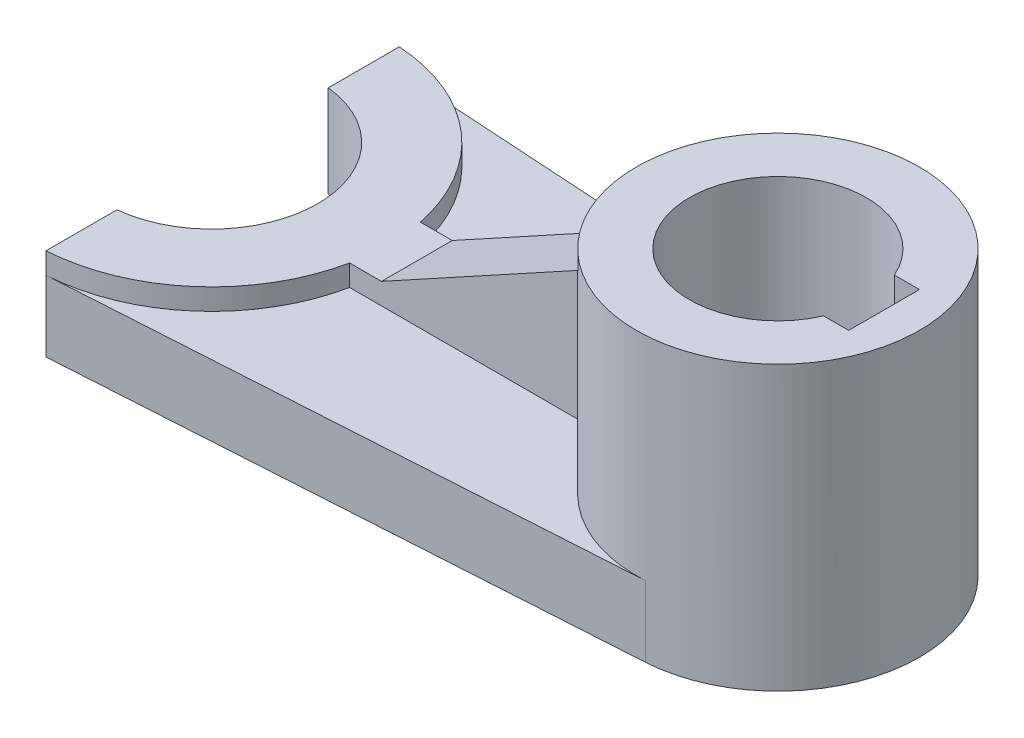
ISO-10303-21;
HEADER;
FILE_DESCRIPTION(('STEP AP214'),'2;1');
FILE_NAME('part.step','',(''),(''),'','','');
FILE_SCHEMA(('AUTOMOTIVE_DESIGN { 1 0 10303 214 1 1 1 1 }'));
ENDSEC;
DATA;
#1=APPLICATION_CONTEXT('core data for automotive mechanical design processes');
#2=APPLICATION_PROTOCOL_DEFINITION('international standard','automotive_design',2000,#1);
#3=PRODUCT_CONTEXT('',#1,'mechanical');
#4=PRODUCT('Part','Part','',(#3));
#5=PRODUCT_RELATED_PRODUCT_CATEGORY('part','',(#4));
#6=PRODUCT_DEFINITION_FORMATION('','',#4);
#7=PRODUCT_DEFINITION_CONTEXT('part definition',#1,'design');
#8=PRODUCT_DEFINITION('design','',#6,#7);
#9=PRODUCT_DEFINITION_SHAPE('','',#8);
#10=(LENGTH_UNIT() NAMED_UNIT(*) SI_UNIT(.MILLI.,.METRE.));
#11=(NAMED_UNIT(*) PLANE_ANGLE_UNIT() SI_UNIT($,.RADIAN.));
#12=(NAMED_UNIT(*) SI_UNIT($,.STERADIAN.) SOLID_ANGLE_UNIT());
#13=UNCERTAINTY_MEASURE_WITH_UNIT(LENGTH_MEASURE(1.E-05),#10,'distance_accuracy_value','');
#14=(GEOMETRIC_REPRESENTATION_CONTEXT(3) GLOBAL_UNCERTAINTY_ASSIGNED_CONTEXT((#13)) GLOBAL_UNIT_ASSIGNED_CONTEXT((#10,
#11,#12)) REPRESENTATION_CONTEXT('',''));
#15=CARTESIAN_POINT('',(0.,0.,0.));
#16=DIRECTION('',(0.,0.,1.));
#17=DIRECTION('',(1.,0.,0.));
#18=AXIS2_PLACEMENT_3D('',#15,#16,#17);
#19=CARTESIAN_POINT('',(0.,10.,0.));
#20=DIRECTION('',(0.,1.,0.));
#21=DIRECTION('',(0.,0.,1.));
#22=AXIS2_PLACEMENT_3D('',#19,#20,#21);
#23=PLANE('',#22);
#24=CARTESIAN_POINT('',(-80.,10.,0.));
#25=DIRECTION('',(0.,1.,0.));
#26=DIRECTION('',(0.,0.,1.));
#27=AXIS2_PLACEMENT_3D('',#24,#25,#26);
#28=CIRCLE('',#27,25.);
#29=CARTESIAN_POINT('',(-78.4375,10.,-24.9511240979239));
#30=VERTEX_POINT('',#29);
#31=CARTESIAN_POINT('',(-55.5051025721682,10.,-5.));
#32=VERTEX_POINT('',#31);
#33=EDGE_CURVE('E246',#30,#32,#28,.F.);
#34=ORIENTED_EDGE('',*,*,#33,.T.);
#35=DIRECTION('',(1.,0.,0.));
#36=VECTOR('',#35,1.);
#37=CARTESIAN_POINT('',(0.,10.,-5.));
#38=LINE('',#37,#36);
#39=CARTESIAN_POINT('',(-19.3649167310371,10.,-5.));
#40=VERTEX_POINT('',#39);
#41=EDGE_CURVE('E215',#32,#40,#38,.T.);
#42=ORIENTED_EDGE('',*,*,#41,.T.);
#43=CARTESIAN_POINT('',(0.,10.,0.));
#44=DIRECTION('',(0.,1.,0.));
#45=DIRECTION('',(0.,0.,1.));
#46=AXIS2_PLACEMENT_3D('',#43,#44,#45);
#47=CIRCLE('',#46,20.);
#48=CARTESIAN_POINT('',(1.25,10.,-19.9608992783391));
#49=VERTEX_POINT('',#48);
#50=EDGE_CURVE('E61',#40,#49,#47,.F.);
#51=ORIENTED_EDGE('',*,*,#50,.T.);
#52=DIRECTION('',(0.998044963916957,0.,0.0625));
#53=VECTOR('',#52,1.);
#54=CARTESIAN_POINT('',(1.25,10.,-19.9608992783391));
#55=LINE('',#54,#53);
#56=EDGE_CURVE('E254',#30,#49,#55,.T.);
#57=ORIENTED_EDGE('',*,*,#56,.F.);
#58=EDGE_LOOP('',(#34,#42,#51,#57));
#59=FACE_BOUND('',#58,.T.);
#60=ADVANCED_FACE('F53',(#59),#23,.T.);
#61=CARTESIAN_POINT('',(-80.,13.,0.));
#62=DIRECTION('',(0.,-1.,0.));
#63=DIRECTION('',(0.,0.,-1.));
#64=AXIS2_PLACEMENT_3D('',#61,#62,#63);
#65=CYLINDRICAL_SURFACE('',#64,25.);
#66=CARTESIAN_POINT('',(-80.,13.,0.));
#67=DIRECTION('',(0.,1.,0.));
#68=DIRECTION('',(0.,0.,1.));
#69=AXIS2_PLACEMENT_3D('',#66,#67,#68);
#70=CIRCLE('',#69,25.);
#71=CARTESIAN_POINT('',(-78.4375,13.,-24.9511240979239));
#72=VERTEX_POINT('',#71);
#73=CARTESIAN_POINT('',(-55.5051025721682,13.,-5.));
#74=VERTEX_POINT('',#73);
#75=EDGE_CURVE('E234',#72,#74,#70,.F.);
#76=ORIENTED_EDGE('',*,*,#75,.T.);
#77=DIRECTION('',(0.,-1.,0.));
#78=VECTOR('',#77,1.);
#79=CARTESIAN_POINT('',(-55.5051025721682,13.,-5.));
#80=LINE('',#79,#78);
#81=EDGE_CURVE('E213',#74,#32,#80,.T.);
#82=ORIENTED_EDGE('',*,*,#81,.T.);
#83=ORIENTED_EDGE('',*,*,#33,.F.);
#84=DIRECTION('',(0.,-1.,0.));
#85=VECTOR('',#84,1.);
#86=CARTESIAN_POINT('',(-78.4375,13.,-24.9511240979239));
#87=LINE('',#86,#85);
#88=EDGE_CURVE('E251',#72,#30,#87,.T.);
#89=ORIENTED_EDGE('',*,*,#88,.F.);
#90=EDGE_LOOP('',(#76,#82,#83,#89));
#91=FACE_BOUND('',#90,.T.);
#92=ADVANCED_FACE('F336',(#91),#65,.T.);
#93=CARTESIAN_POINT('',(1.25,10.,-19.9608992783391));
#94=DIRECTION('',(0.0625,0.,-0.998044963916957));
#95=DIRECTION('',(-0.998044963916957,0.,-0.0625));
#96=AXIS2_PLACEMENT_3D('',#93,#94,#95);
#97=PLANE('',#96);
#98=DIRECTION('',(0.998044963916957,0.,0.0625));
#99=VECTOR('',#98,1.);
#100=CARTESIAN_POINT('',(1.25,0.,-19.9608992783391));
#101=LINE('',#100,#99);
#102=CARTESIAN_POINT('',(-78.4375,0.,-24.9511240979239));
#103=VERTEX_POINT('',#102);
#104=CARTESIAN_POINT('',(1.25,0.,-19.9608992783391));
#105=VERTEX_POINT('',#104);
#106=EDGE_CURVE('E253',#103,#105,#101,.T.);
#107=ORIENTED_EDGE('',*,*,#106,.F.);
#108=DIRECTION('',(0.,-1.,0.));
#109=VECTOR('',#108,1.);
#110=CARTESIAN_POINT('',(-78.4375,10.,-24.9511240979239));
#111=LINE('',#110,#109);
#112=EDGE_CURVE('E285',#30,#103,#111,.T.);
#113=ORIENTED_EDGE('',*,*,#112,.F.);
#114=ORIENTED_EDGE('',*,*,#56,.T.);
#115=DIRECTION('',(0.,-1.,0.));
#116=VECTOR('',#115,1.);
#117=CARTESIAN_POINT('',(1.25,10.,-19.9608992783391));
#118=LINE('',#117,#116);
#119=EDGE_CURVE('E261',#49,#105,#118,.T.);
#120=ORIENTED_EDGE('',*,*,#119,.T.);
#121=EDGE_LOOP('',(#107,#113,#114,#120));
#122=FACE_BOUND('',#121,.T.);
#123=ADVANCED_FACE('F55',(#122),#97,.T.);
#124=CARTESIAN_POINT('',(-78.4375,10.,0.));
#125=DIRECTION('',(1.,0.,0.));
#126=DIRECTION('',(0.,0.,-1.));
#127=AXIS2_PLACEMENT_3D('',#124,#125,#126);
#128=PLANE('',#127);
#129=DIRECTION('',(0.,0.,1.));
#130=VECTOR('',#129,1.);
#131=CARTESIAN_POINT('',(-78.4375,0.,0.));
#132=LINE('',#131,#130);
#133=CARTESIAN_POINT('',(-78.4375,0.,-14.91839782785));
#134=VERTEX_POINT('',#133);
#135=EDGE_CURVE('E264',#103,#134,#132,.T.);
#136=ORIENTED_EDGE('',*,*,#135,.T.);
#137=DIRECTION('',(0.,-1.,0.));
#138=VECTOR('',#137,1.);
#139=CARTESIAN_POINT('',(-78.4375,10.,-14.91839782785));
#140=LINE('',#139,#138);
#141=CARTESIAN_POINT('',(-78.4375,13.,-14.91839782785));
#142=VERTEX_POINT('',#141);
#143=EDGE_CURVE('E283',#142,#134,#140,.T.);
#144=ORIENTED_EDGE('',*,*,#143,.F.);
#145=DIRECTION('',(0.,0.,1.));
#146=VECTOR('',#145,1.);
#147=CARTESIAN_POINT('',(-78.4375,13.,0.));
#148=LINE('',#147,#146);
#149=EDGE_CURVE('E236',#72,#142,#148,.T.);
#150=ORIENTED_EDGE('',*,*,#149,.F.);
#151=ORIENTED_EDGE('',*,*,#88,.T.);
#152=ORIENTED_EDGE('',*,*,#112,.T.);
#153=EDGE_LOOP('',(#136,#144,#150,#151,#152));
#154=FACE_BOUND('',#153,.T.);
#155=ADVANCED_FACE('F302',(#154),#128,.F.);
#156=CARTESIAN_POINT('',(-80.,10.,0.));
#157=DIRECTION('',(0.,-1.,0.));
#158=DIRECTION('',(0.,0.,-1.));
#159=AXIS2_PLACEMENT_3D('',#156,#157,#158);
#160=CYLINDRICAL_SURFACE('',#159,15.);
#161=DIRECTION('',(0.,-1.,0.));
#162=VECTOR('',#161,1.);
#163=CARTESIAN_POINT('',(-78.4375,10.,14.91839782785));
#164=LINE('',#163,#162);
#165=CARTESIAN_POINT('',(-78.4375,13.,14.91839782785));
#166=VERTEX_POINT('',#165);
#167=CARTESIAN_POINT('',(-78.4375,0.,14.91839782785));
#168=VERTEX_POINT('',#167);
#169=EDGE_CURVE('E281',#166,#168,#164,.T.);
#170=ORIENTED_EDGE('',*,*,#169,.F.);
#171=CARTESIAN_POINT('',(-80.,13.,0.));
#172=DIRECTION('',(0.,1.,0.));
#173=DIRECTION('',(0.,0.,1.));
#174=AXIS2_PLACEMENT_3D('',#171,#172,#173);
#175=CIRCLE('',#174,15.);
#176=EDGE_CURVE('E240',#142,#166,#175,.F.);
#177=ORIENTED_EDGE('',*,*,#176,.F.);
#178=ORIENTED_EDGE('',*,*,#143,.T.);
#179=CARTESIAN_POINT('',(-80.,0.,0.));
#180=DIRECTION('',(0.,1.,0.));
#181=DIRECTION('',(0.,0.,1.));
#182=AXIS2_PLACEMENT_3D('',#179,#180,#181);
#183=CIRCLE('',#182,15.);
#184=EDGE_CURVE('E267',#168,#134,#183,.T.);
#185=ORIENTED_EDGE('',*,*,#184,.F.);
#186=EDGE_LOOP('',(#170,#177,#178,#185));
#187=FACE_BOUND('',#186,.T.);
#188=ADVANCED_FACE('F311',(#187),#160,.F.);
#189=CARTESIAN_POINT('',(-78.4375,0.,24.9511240979239));
#190=VERTEX_POINT('',#189);
#191=EDGE_CURVE('E268',#168,#190,#132,.T.);
#192=ORIENTED_EDGE('',*,*,#191,.T.);
#193=DIRECTION('',(0.,-1.,0.));
#194=VECTOR('',#193,1.);
#195=CARTESIAN_POINT('',(-78.4375,10.,24.9511240979239));
#196=LINE('',#195,#194);
#197=CARTESIAN_POINT('',(-78.4375,10.,24.9511240979239));
#198=VERTEX_POINT('',#197);
#199=EDGE_CURVE('E278',#198,#190,#196,.T.);
#200=ORIENTED_EDGE('',*,*,#199,.F.);
#201=DIRECTION('',(0.,-1.,0.));
#202=VECTOR('',#201,1.);
#203=CARTESIAN_POINT('',(-78.4375,13.,24.9511240979239));
#204=LINE('',#203,#202);
#205=CARTESIAN_POINT('',(-78.4375,13.,24.9511240979239));
#206=VERTEX_POINT('',#205);
#207=EDGE_CURVE('E245',#206,#198,#204,.T.);
#208=ORIENTED_EDGE('',*,*,#207,.F.);
#209=DIRECTION('',(0.,0.,1.));
#210=VECTOR('',#209,1.);
#211=CARTESIAN_POINT('',(-78.4375,13.,0.));
#212=LINE('',#211,#210);
#213=EDGE_CURVE('E242',#166,#206,#212,.T.);
#214=ORIENTED_EDGE('',*,*,#213,.F.);
#215=ORIENTED_EDGE('',*,*,#169,.T.);
#216=EDGE_LOOP('',(#192,#200,#208,#214,#215));
#217=FACE_BOUND('',#216,.T.);
#218=ADVANCED_FACE('F315',(#217),#128,.F.);
#219=CARTESIAN_POINT('',(1.25,10.,19.9608992783391));
#220=DIRECTION('',(-0.0624999999999999,0.,-0.998044963916957));
#221=DIRECTION('',(-0.998044963916957,0.,0.0624999999999999));
#222=AXIS2_PLACEMENT_3D('',#219,#220,#221);
#223=PLANE('',#222);
#224=DIRECTION('',(0.998044963916957,0.,-0.0624999999999999));
#225=VECTOR('',#224,1.);
#226=CARTESIAN_POINT('',(1.25,0.,19.9608992783391));
#227=LINE('',#226,#225);
#228=CARTESIAN_POINT('',(1.25,0.,19.9608992783391));
#229=VERTEX_POINT('',#228);
#230=EDGE_CURVE('E270',#190,#229,#227,.T.);
#231=ORIENTED_EDGE('',*,*,#230,.T.);
#232=DIRECTION('',(0.,-1.,0.));
#233=VECTOR('',#232,1.);
#234=CARTESIAN_POINT('',(1.25,10.,19.9608992783391));
#235=LINE('',#234,#233);
#236=CARTESIAN_POINT('',(1.25,10.,19.9608992783391));
#237=VERTEX_POINT('',#236);
#238=EDGE_CURVE('E275',#237,#229,#235,.T.);
#239=ORIENTED_EDGE('',*,*,#238,.F.);
#240=DIRECTION('',(0.998044963916957,0.,-0.0624999999999999));
#241=VECTOR('',#240,1.);
#242=CARTESIAN_POINT('',(1.25,10.,19.9608992783391));
#243=LINE('',#242,#241);
#244=EDGE_CURVE('E257',#198,#237,#243,.T.);
#245=ORIENTED_EDGE('',*,*,#244,.F.);
#246=ORIENTED_EDGE('',*,*,#199,.T.);
#247=EDGE_LOOP('',(#231,#239,#245,#246));
#248=FACE_BOUND('',#247,.T.);
#249=ADVANCED_FACE('F360',(#248),#223,.F.);
#250=CARTESIAN_POINT('',(0.,10.,0.));
#251=DIRECTION('',(0.,-1.,0.));
#252=DIRECTION('',(0.,0.,-1.));
#253=AXIS2_PLACEMENT_3D('',#250,#251,#252);
#254=CYLINDRICAL_SURFACE('',#253,20.);
#255=CARTESIAN_POINT('',(0.,40.,0.));
#256=DIRECTION('',(0.,1.,0.));
#257=DIRECTION('',(0.,0.,1.));
#258=AXIS2_PLACEMENT_3D('',#255,#256,#257);
#259=CIRCLE('',#258,20.);
#260=CARTESIAN_POINT('',(0.,40.,20.));
#261=VERTEX_POINT('',#260);
#262=EDGE_CURVE('E230',#261,#261,#259,.T.);
#263=ORIENTED_EDGE('',*,*,#262,.F.);
#264=EDGE_LOOP('',(#263));
#265=FACE_BOUND('',#264,.T.);
#266=CARTESIAN_POINT('',(0.,0.,0.));
#267=DIRECTION('',(0.,1.,0.));
#268=DIRECTION('',(0.,0.,1.));
#269=AXIS2_PLACEMENT_3D('',#266,#267,#268);
#270=CIRCLE('',#269,20.);
#271=EDGE_CURVE('E258',#229,#105,#270,.T.);
#272=ORIENTED_EDGE('',*,*,#271,.T.);
#273=ORIENTED_EDGE('',*,*,#119,.F.);
#274=ORIENTED_EDGE('',*,*,#50,.F.);
#275=DIRECTION('',(0.,-1.,0.));
#276=VECTOR('',#275,1.);
#277=CARTESIAN_POINT('',(-19.3649167310371,10.,-5.));
#278=LINE('',#277,#276);
#279=CARTESIAN_POINT('',(-19.3649167310371,30.3482714700764,-5.));
#280=VERTEX_POINT('',#279);
#281=EDGE_CURVE('E217',#280,#40,#278,.T.);
#282=ORIENTED_EDGE('',*,*,#281,.F.);
#283=CARTESIAN_POINT('',(0.,40.9677419354839,0.));
#284=DIRECTION('',(0.480832611206852,-0.876812408671319,0.));
#285=DIRECTION('',(-0.876812408671319,-0.480832611206852,0.));
#286=AXIS2_PLACEMENT_3D('',#283,#284,#285);
#287=ELLIPSE('',#286,22.809896167308,20.);
#288=CARTESIAN_POINT('',(-19.3649167310371,30.3482714700764,5.));
#289=VERTEX_POINT('',#288);
#290=EDGE_CURVE('E228',#280,#289,#287,.F.);
#291=ORIENTED_EDGE('',*,*,#290,.T.);
#292=DIRECTION('',(0.,-1.,0.));
#293=VECTOR('',#292,1.);
#294=CARTESIAN_POINT('',(-19.3649167310371,10.,5.));
#295=LINE('',#294,#293);
#296=CARTESIAN_POINT('',(-19.3649167310371,10.,5.));
#297=VERTEX_POINT('',#296);
#298=EDGE_CURVE('E226',#289,#297,#295,.T.);
#299=ORIENTED_EDGE('',*,*,#298,.T.);
#300=EDGE_CURVE('E13',#237,#297,#47,.F.);
#301=ORIENTED_EDGE('',*,*,#300,.F.);
#302=ORIENTED_EDGE('',*,*,#238,.T.);
#303=EDGE_LOOP('',(#272,#273,#274,#282,#291,#299,#301,#302));
#304=FACE_BOUND('',#303,.T.);
#305=ADVANCED_FACE('F295',(#265,#304),#254,.T.);
#306=DIRECTION('',(1.,0.,0.));
#307=VECTOR('',#306,1.);
#308=CARTESIAN_POINT('',(0.,10.,5.));
#309=LINE('',#308,#307);
#310=CARTESIAN_POINT('',(-55.5051025721682,10.,5.));
#311=VERTEX_POINT('',#310);
#312=EDGE_CURVE('E223',#311,#297,#309,.T.);
#313=ORIENTED_EDGE('',*,*,#312,.F.);
#314=EDGE_CURVE('E233',#311,#198,#28,.F.);
#315=ORIENTED_EDGE('',*,*,#314,.T.);
#316=ORIENTED_EDGE('',*,*,#244,.T.);
#317=ORIENTED_EDGE('',*,*,#300,.T.);
#318=EDGE_LOOP('',(#313,#315,#316,#317));
#319=FACE_BOUND('',#318,.T.);
#320=ADVANCED_FACE('F344',(#319),#23,.T.);
#321=CARTESIAN_POINT('',(0.,0.,0.));
#322=DIRECTION('',(0.,1.,0.));
#323=DIRECTION('',(0.,0.,1.));
#324=AXIS2_PLACEMENT_3D('',#321,#322,#323);
#325=PLANE('',#324);
#326=DIRECTION('',(1.,0.,0.));
#327=VECTOR('',#326,1.);
#328=CARTESIAN_POINT('',(0.,0.,-5.));
#329=LINE('',#328,#327);
#330=CARTESIAN_POINT('',(11.4564392373896,0.,-5.));
#331=VERTEX_POINT('',#330);
#332=CARTESIAN_POINT('',(15.,0.,-5.));
#333=VERTEX_POINT('',#332);
#334=EDGE_CURVE('E171',#331,#333,#329,.T.);
#335=ORIENTED_EDGE('',*,*,#334,.F.);
#336=CARTESIAN_POINT('',(0.,0.,0.));
#337=DIRECTION('',(0.,1.,0.));
#338=DIRECTION('',(0.,0.,1.));
#339=AXIS2_PLACEMENT_3D('',#336,#337,#338);
#340=CIRCLE('',#339,12.5);
#341=CARTESIAN_POINT('',(11.4564392373896,0.,4.99999999999999));
#342=VERTEX_POINT('',#341);
#343=EDGE_CURVE('E168',#331,#342,#340,.T.);
#344=ORIENTED_EDGE('',*,*,#343,.T.);
#345=DIRECTION('',(1.,0.,0.));
#346=VECTOR('',#345,1.);
#347=CARTESIAN_POINT('',(0.,0.,5.));
#348=LINE('',#347,#346);
#349=CARTESIAN_POINT('',(15.,0.,4.99999999999999));
#350=VERTEX_POINT('',#349);
#351=EDGE_CURVE('E174',#342,#350,#348,.T.);
#352=ORIENTED_EDGE('',*,*,#351,.T.);
#353=DIRECTION('',(0.,0.,1.));
#354=VECTOR('',#353,1.);
#355=CARTESIAN_POINT('',(15.,0.,0.));
#356=LINE('',#355,#354);
#357=EDGE_CURVE('E178',#333,#350,#356,.T.);
#358=ORIENTED_EDGE('',*,*,#357,.F.);
#359=EDGE_LOOP('',(#335,#344,#352,#358));
#360=FACE_BOUND('',#359,.T.);
#361=ORIENTED_EDGE('',*,*,#184,.T.);
#362=ORIENTED_EDGE('',*,*,#135,.F.);
#363=ORIENTED_EDGE('',*,*,#106,.T.);
#364=ORIENTED_EDGE('',*,*,#271,.F.);
#365=ORIENTED_EDGE('',*,*,#230,.F.);
#366=ORIENTED_EDGE('',*,*,#191,.F.);
#367=EDGE_LOOP('',(#361,#362,#363,#364,#365,#366));
#368=FACE_BOUND('',#367,.T.);
#369=ADVANCED_FACE('F180',(#360,#368),#325,.F.);
#370=DIRECTION('',(0.,-1.,0.));
#371=VECTOR('',#370,1.);
#372=CARTESIAN_POINT('',(-55.5051025721682,13.,5.));
#373=LINE('',#372,#371);
#374=CARTESIAN_POINT('',(-55.5051025721682,13.,5.));
#375=VERTEX_POINT('',#374);
#376=EDGE_CURVE('E220',#375,#311,#373,.T.);
#377=ORIENTED_EDGE('',*,*,#376,.F.);
#378=EDGE_CURVE('E237',#375,#206,#70,.F.);
#379=ORIENTED_EDGE('',*,*,#378,.T.);
#380=ORIENTED_EDGE('',*,*,#207,.T.);
#381=ORIENTED_EDGE('',*,*,#314,.F.);
#382=EDGE_LOOP('',(#377,#379,#380,#381));
#383=FACE_BOUND('',#382,.T.);
#384=ADVANCED_FACE('F322',(#383),#65,.T.);
#385=CARTESIAN_POINT('',(0.,13.,0.));
#386=DIRECTION('',(0.,1.,0.));
#387=DIRECTION('',(0.,0.,1.));
#388=AXIS2_PLACEMENT_3D('',#385,#386,#387);
#389=PLANE('',#388);
#390=ORIENTED_EDGE('',*,*,#378,.F.);
#391=DIRECTION('',(1.,0.,0.));
#392=VECTOR('',#391,1.);
#393=CARTESIAN_POINT('',(-29.21875,13.,5.));
#394=LINE('',#393,#392);
#395=CARTESIAN_POINT('',(-51.,13.,5.));
#396=VERTEX_POINT('',#395);
#397=EDGE_CURVE('E201',#375,#396,#394,.T.);
#398=ORIENTED_EDGE('',*,*,#397,.T.);
#399=DIRECTION('',(0.,0.,1.));
#400=VECTOR('',#399,1.);
#401=CARTESIAN_POINT('',(-51.,13.,0.));
#402=LINE('',#401,#400);
#403=CARTESIAN_POINT('',(-51.,13.,-5.));
#404=VERTEX_POINT('',#403);
#405=EDGE_CURVE('E203',#404,#396,#402,.T.);
#406=ORIENTED_EDGE('',*,*,#405,.F.);
#407=DIRECTION('',(1.,0.,0.));
#408=VECTOR('',#407,1.);
#409=CARTESIAN_POINT('',(-29.21875,13.,-5.));
#410=LINE('',#409,#408);
#411=EDGE_CURVE('E207',#74,#404,#410,.T.);
#412=ORIENTED_EDGE('',*,*,#411,.F.);
#413=ORIENTED_EDGE('',*,*,#75,.F.);
#414=ORIENTED_EDGE('',*,*,#149,.T.);
#415=ORIENTED_EDGE('',*,*,#176,.T.);
#416=ORIENTED_EDGE('',*,*,#213,.T.);
#417=EDGE_LOOP('',(#390,#398,#406,#412,#413,#414,#415,#416));
#418=FACE_BOUND('',#417,.T.);
#419=ADVANCED_FACE('F308',(#418),#389,.T.);
#420=CARTESIAN_POINT('',(0.,40.,0.));
#421=DIRECTION('',(0.,1.,0.));
#422=DIRECTION('',(0.,0.,1.));
#423=AXIS2_PLACEMENT_3D('',#420,#421,#422);
#424=PLANE('',#423);
#425=CARTESIAN_POINT('',(0.,40.,0.));
#426=DIRECTION('',(0.,1.,0.));
#427=DIRECTION('',(0.,0.,1.));
#428=AXIS2_PLACEMENT_3D('',#425,#426,#427);
#429=CIRCLE('',#428,12.5);
#430=CARTESIAN_POINT('',(11.4564392373896,40.,-5.));
#431=VERTEX_POINT('',#430);
#432=CARTESIAN_POINT('',(11.4564392373896,40.,4.99999999999999));
#433=VERTEX_POINT('',#432);
#434=EDGE_CURVE('E76',#431,#433,#429,.T.);
#435=ORIENTED_EDGE('',*,*,#434,.F.);
#436=DIRECTION('',(1.,0.,0.));
#437=VECTOR('',#436,1.);
#438=CARTESIAN_POINT('',(0.,40.,-5.));
#439=LINE('',#438,#437);
#440=CARTESIAN_POINT('',(15.,40.,-5.));
#441=VERTEX_POINT('',#440);
#442=EDGE_CURVE('E182',#431,#441,#439,.T.);
#443=ORIENTED_EDGE('',*,*,#442,.T.);
#444=DIRECTION('',(0.,0.,1.));
#445=VECTOR('',#444,1.);
#446=CARTESIAN_POINT('',(15.,40.,0.));
#447=LINE('',#446,#445);
#448=CARTESIAN_POINT('',(15.,40.,4.99999999999999));
#449=VERTEX_POINT('',#448);
#450=EDGE_CURVE('E185',#441,#449,#447,.T.);
#451=ORIENTED_EDGE('',*,*,#450,.T.);
#452=DIRECTION('',(1.,0.,0.));
#453=VECTOR('',#452,1.);
#454=CARTESIAN_POINT('',(0.,40.,5.));
#455=LINE('',#454,#453);
#456=EDGE_CURVE('E191',#433,#449,#455,.T.);
#457=ORIENTED_EDGE('',*,*,#456,.F.);
#458=EDGE_LOOP('',(#435,#443,#451,#457));
#459=FACE_BOUND('',#458,.T.);
#460=ORIENTED_EDGE('',*,*,#262,.T.);
#461=EDGE_LOOP('',(#460));
#462=FACE_BOUND('',#461,.T.);
#463=ADVANCED_FACE('F351',(#459,#462),#424,.T.);
#464=CARTESIAN_POINT('',(-51.,13.,0.));
#465=DIRECTION('',(0.480832611206852,-0.876812408671319,0.));
#466=DIRECTION('',(0.876812408671319,0.480832611206852,0.));
#467=AXIS2_PLACEMENT_3D('',#464,#465,#466);
#468=PLANE('',#467);
#469=ORIENTED_EDGE('',*,*,#290,.F.);
#470=DIRECTION('',(0.876812408671319,0.480832611206852,0.));
#471=VECTOR('',#470,1.);
#472=CARTESIAN_POINT('',(-51.,13.,-5.));
#473=LINE('',#472,#471);
#474=EDGE_CURVE('E197',#404,#280,#473,.T.);
#475=ORIENTED_EDGE('',*,*,#474,.F.);
#476=ORIENTED_EDGE('',*,*,#405,.T.);
#477=DIRECTION('',(0.876812408671319,0.480832611206852,0.));
#478=VECTOR('',#477,1.);
#479=CARTESIAN_POINT('',(-51.,13.,5.));
#480=LINE('',#479,#478);
#481=EDGE_CURVE('E204',#396,#289,#480,.T.);
#482=ORIENTED_EDGE('',*,*,#481,.T.);
#483=EDGE_LOOP('',(#469,#475,#476,#482));
#484=FACE_BOUND('',#483,.T.);
#485=ADVANCED_FACE('F329',(#484),#468,.F.);
#486=CARTESIAN_POINT('',(-29.21875,20.,5.));
#487=DIRECTION('',(0.,0.,1.));
#488=DIRECTION('',(1.,0.,0.));
#489=AXIS2_PLACEMENT_3D('',#486,#487,#488);
#490=PLANE('',#489);
#491=ORIENTED_EDGE('',*,*,#298,.F.);
#492=ORIENTED_EDGE('',*,*,#481,.F.);
#493=ORIENTED_EDGE('',*,*,#397,.F.);
#494=ORIENTED_EDGE('',*,*,#376,.T.);
#495=ORIENTED_EDGE('',*,*,#312,.T.);
#496=EDGE_LOOP('',(#491,#492,#493,#494,#495));
#497=FACE_BOUND('',#496,.T.);
#498=ADVANCED_FACE('F326',(#497),#490,.T.);
#499=CARTESIAN_POINT('',(-29.21875,20.,-5.));
#500=DIRECTION('',(0.,0.,1.));
#501=DIRECTION('',(1.,0.,0.));
#502=AXIS2_PLACEMENT_3D('',#499,#500,#501);
#503=PLANE('',#502);
#504=ORIENTED_EDGE('',*,*,#474,.T.);
#505=ORIENTED_EDGE('',*,*,#281,.T.);
#506=ORIENTED_EDGE('',*,*,#41,.F.);
#507=ORIENTED_EDGE('',*,*,#81,.F.);
#508=ORIENTED_EDGE('',*,*,#411,.T.);
#509=EDGE_LOOP('',(#504,#505,#506,#507,#508));
#510=FACE_BOUND('',#509,.T.);
#511=ADVANCED_FACE('F333',(#510),#503,.F.);
#512=CARTESIAN_POINT('',(0.,0.,0.));
#513=DIRECTION('',(0.,1.,0.));
#514=DIRECTION('',(0.,0.,1.));
#515=AXIS2_PLACEMENT_3D('',#512,#513,#514);
#516=CYLINDRICAL_SURFACE('',#515,12.5);
#517=ORIENTED_EDGE('',*,*,#434,.T.);
#518=DIRECTION('',(0.,1.,0.));
#519=VECTOR('',#518,1.);
#520=CARTESIAN_POINT('',(11.4564392373896,0.,4.99999999999999));
#521=LINE('',#520,#519);
#522=EDGE_CURVE('E165',#342,#433,#521,.T.);
#523=ORIENTED_EDGE('',*,*,#522,.F.);
#524=ORIENTED_EDGE('',*,*,#343,.F.);
#525=DIRECTION('',(0.,1.,0.));
#526=VECTOR('',#525,1.);
#527=CARTESIAN_POINT('',(11.4564392373896,0.,-5.));
#528=LINE('',#527,#526);
#529=EDGE_CURVE('E195',#331,#431,#528,.T.);
#530=ORIENTED_EDGE('',*,*,#529,.T.);
#531=EDGE_LOOP('',(#517,#523,#524,#530));
#532=FACE_BOUND('',#531,.T.);
#533=ADVANCED_FACE('F166',(#532),#516,.F.);
#534=CARTESIAN_POINT('',(0.,0.,-5.));
#535=DIRECTION('',(0.,0.,1.));
#536=DIRECTION('',(1.,0.,0.));
#537=AXIS2_PLACEMENT_3D('',#534,#535,#536);
#538=PLANE('',#537);
#539=ORIENTED_EDGE('',*,*,#442,.F.);
#540=ORIENTED_EDGE('',*,*,#529,.F.);
#541=ORIENTED_EDGE('',*,*,#334,.T.);
#542=DIRECTION('',(0.,1.,0.));
#543=VECTOR('',#542,1.);
#544=CARTESIAN_POINT('',(15.,0.,-5.));
#545=LINE('',#544,#543);
#546=EDGE_CURVE('E198',#333,#441,#545,.T.);
#547=ORIENTED_EDGE('',*,*,#546,.T.);
#548=EDGE_LOOP('',(#539,#540,#541,#547));
#549=FACE_BOUND('',#548,.T.);
#550=ADVANCED_FACE('F477',(#549),#538,.T.);
#551=CARTESIAN_POINT('',(15.,0.,0.));
#552=DIRECTION('',(-1.,0.,0.));
#553=DIRECTION('',(0.,0.,1.));
#554=AXIS2_PLACEMENT_3D('',#551,#552,#553);
#555=PLANE('',#554);
#556=ORIENTED_EDGE('',*,*,#450,.F.);
#557=ORIENTED_EDGE('',*,*,#546,.F.);
#558=ORIENTED_EDGE('',*,*,#357,.T.);
#559=DIRECTION('',(0.,1.,0.));
#560=VECTOR('',#559,1.);
#561=CARTESIAN_POINT('',(15.,0.,4.99999999999999));
#562=LINE('',#561,#560);
#563=EDGE_CURVE('E68',#350,#449,#562,.T.);
#564=ORIENTED_EDGE('',*,*,#563,.T.);
#565=EDGE_LOOP('',(#556,#557,#558,#564));
#566=FACE_BOUND('',#565,.T.);
#567=ADVANCED_FACE('F486',(#566),#555,.T.);
#568=CARTESIAN_POINT('',(0.,0.,5.));
#569=DIRECTION('',(0.,0.,1.));
#570=DIRECTION('',(1.,0.,0.));
#571=AXIS2_PLACEMENT_3D('',#568,#569,#570);
#572=PLANE('',#571);
#573=ORIENTED_EDGE('',*,*,#456,.T.);
#574=ORIENTED_EDGE('',*,*,#563,.F.);
#575=ORIENTED_EDGE('',*,*,#351,.F.);
#576=ORIENTED_EDGE('',*,*,#522,.T.);
#577=EDGE_LOOP('',(#573,#574,#575,#576));
#578=FACE_BOUND('',#577,.T.);
#579=ADVANCED_FACE('F175',(#578),#572,.F.);
#580=CLOSED_SHELL('',(#60,#92,#123,#155,#188,#218,#249,#305,#320,#369,#384,#419,#463,#485,#498,
#511,#533,#550,#567,#579));
#581=MANIFOLD_SOLID_BREP('B2',#580);
#582=ADVANCED_BREP_SHAPE_REPRESENTATION('',(#18,#581),#14);
#583=SHAPE_DEFINITION_REPRESENTATION(#9,#582);
ENDSEC;
END-ISO-10303-21;
